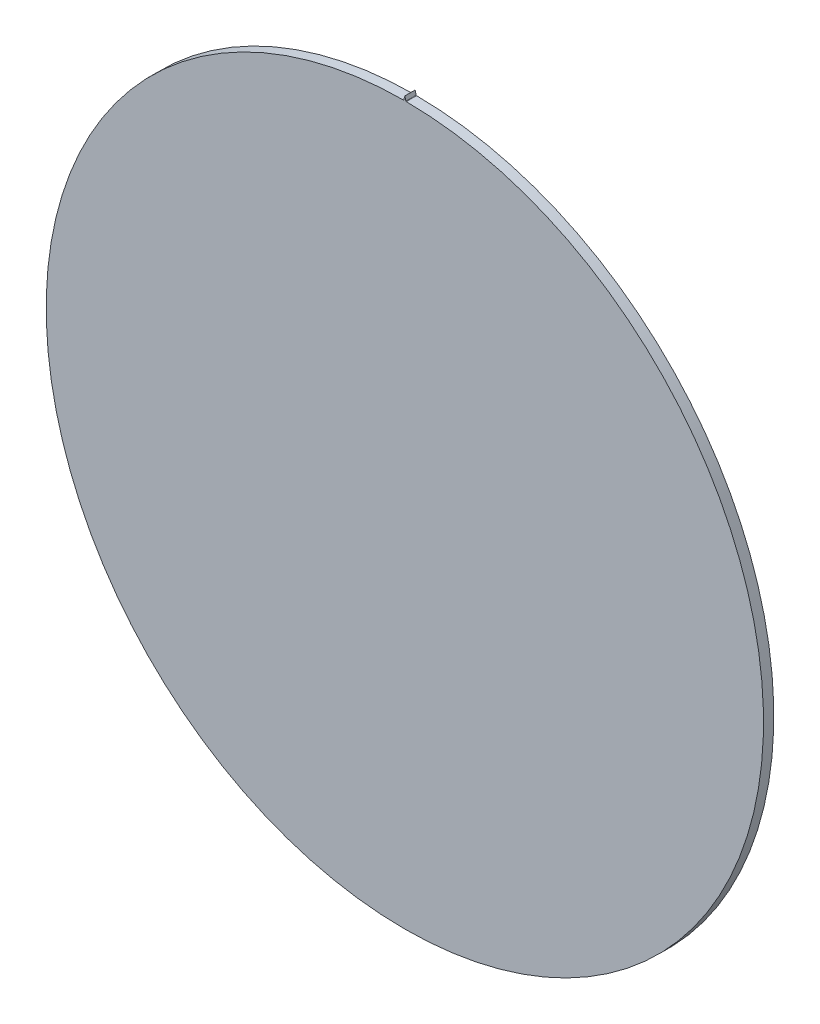
ISO-10303-21;
HEADER;
FILE_DESCRIPTION(('STEP AP214'),'2;1');
FILE_NAME('part.step','',(''),(''),'','','');
FILE_SCHEMA(('AUTOMOTIVE_DESIGN { 1 0 10303 214 1 1 1 1 }'));
ENDSEC;
DATA;
#1=APPLICATION_CONTEXT('core data for automotive mechanical design processes');
#2=APPLICATION_PROTOCOL_DEFINITION('international standard','automotive_design',2000,#1);
#3=PRODUCT_CONTEXT('',#1,'mechanical');
#4=PRODUCT('Part','Part','',(#3));
#5=PRODUCT_RELATED_PRODUCT_CATEGORY('part','',(#4));
#6=PRODUCT_DEFINITION_FORMATION('','',#4);
#7=PRODUCT_DEFINITION_CONTEXT('part definition',#1,'design');
#8=PRODUCT_DEFINITION('design','',#6,#7);
#9=PRODUCT_DEFINITION_SHAPE('','',#8);
#10=(LENGTH_UNIT() NAMED_UNIT(*) SI_UNIT(.MILLI.,.METRE.));
#11=(NAMED_UNIT(*) PLANE_ANGLE_UNIT() SI_UNIT($,.RADIAN.));
#12=(NAMED_UNIT(*) SI_UNIT($,.STERADIAN.) SOLID_ANGLE_UNIT());
#13=UNCERTAINTY_MEASURE_WITH_UNIT(LENGTH_MEASURE(1.E-05),#10,'distance_accuracy_value','');
#14=(GEOMETRIC_REPRESENTATION_CONTEXT(3) GLOBAL_UNCERTAINTY_ASSIGNED_CONTEXT((#13)) GLOBAL_UNIT_ASSIGNED_CONTEXT((#10,
#11,#12)) REPRESENTATION_CONTEXT('',''));
#15=CARTESIAN_POINT('',(0.,0.,0.));
#16=DIRECTION('',(0.,0.,1.));
#17=DIRECTION('',(1.,0.,0.));
#18=AXIS2_PLACEMENT_3D('',#15,#16,#17);
#19=CARTESIAN_POINT('',(0.,352.869005618267,10.));
#20=CARTESIAN_POINT('',(-0.0782322744899761,352.599791154151,10.));
#21=CARTESIAN_POINT('',(-0.192981436895399,352.198529985195,10.));
#22=CARTESIAN_POINT('',(-0.34132972041963,351.666617724108,10.));
#23=CARTESIAN_POINT('',(-0.448333974762531,351.276418011394,10.));
#24=CARTESIAN_POINT('',(-0.551988003788558,350.891907378865,10.));
#25=CARTESIAN_POINT('',(-0.652343171304687,350.513107425822,10.));
#26=CARTESIAN_POINT('',(-0.749450979050035,350.140039412834,10.));
#27=CARTESIAN_POINT('',(-0.873615316426641,349.654399425018,10.));
#28=CARTESIAN_POINT('',(-0.963620124942637,349.292664319115,10.));
#29=CARTESIAN_POINT('',(-1.02205554260628,349.053309932902,10.));
#30=B_SPLINE_CURVE_WITH_KNOTS('',3,(#19,#20,#21,#22,#23,#24,#25,#26,#27,#28,#29),.UNSPECIFIED.,
.F.,.F.,(4,1,1,1,1,1,1,1,4),(0.,0.212897122256029,0.316927472961058,0.419345683384068,
0.520151753525033,0.619345683384038,0.716927472961031,0.812897122256021,1.),.UNSPECIFIED.);
#31=DIRECTION('',(0.,0.,-1.));
#32=VECTOR('',#31,1.);
#33=SURFACE_OF_LINEAR_EXTRUSION('',#30,#32);
#34=CARTESIAN_POINT('',(0.,352.869005618267,0.));
#35=CARTESIAN_POINT('',(-0.0782322744899761,352.599791154151,0.));
#36=CARTESIAN_POINT('',(-0.192981436895399,352.198529985195,0.));
#37=CARTESIAN_POINT('',(-0.34132972041963,351.666617724108,0.));
#38=CARTESIAN_POINT('',(-0.448333974762531,351.276418011394,0.));
#39=CARTESIAN_POINT('',(-0.551988003788558,350.891907378865,0.));
#40=CARTESIAN_POINT('',(-0.652343171304687,350.513107425822,0.));
#41=CARTESIAN_POINT('',(-0.749450979050035,350.140039412834,0.));
#42=CARTESIAN_POINT('',(-0.873615316426641,349.654399425018,0.));
#43=CARTESIAN_POINT('',(-0.963620124942637,349.292664319115,0.));
#44=CARTESIAN_POINT('',(-1.02205554260628,349.053309932902,0.));
#45=B_SPLINE_CURVE_WITH_KNOTS('',3,(#34,#35,#36,#37,#38,#39,#40,#41,#42,#43,#44),.UNSPECIFIED.,
.F.,.F.,(4,1,1,1,1,1,1,1,4),(0.,0.212897122256029,0.316927472961058,0.419345683384068,
0.520151753525033,0.619345683384038,0.716927472961031,0.812897122256021,1.),.UNSPECIFIED.);
#46=CARTESIAN_POINT('',(0.,352.869005618267,0.));
#47=VERTEX_POINT('',#46);
#48=CARTESIAN_POINT('',(-1.02205554260628,349.053309932902,0.));
#49=VERTEX_POINT('',#48);
#50=EDGE_CURVE('E130',#47,#49,#45,.T.);
#51=ORIENTED_EDGE('',*,*,#50,.T.);
#52=DIRECTION('',(0.,0.,-1.));
#53=VECTOR('',#52,1.);
#54=CARTESIAN_POINT('',(-1.02205554260628,349.053309932902,10.));
#55=LINE('',#54,#53);
#56=CARTESIAN_POINT('',(-1.02205554260628,349.053309932902,10.));
#57=VERTEX_POINT('',#56);
#58=EDGE_CURVE('E11',#57,#49,#55,.T.);
#59=ORIENTED_EDGE('',*,*,#58,.F.);
#60=CARTESIAN_POINT('',(0.,352.869005618267,10.));
#61=VERTEX_POINT('',#60);
#62=EDGE_CURVE('E165',#61,#57,#30,.T.);
#63=ORIENTED_EDGE('',*,*,#62,.F.);
#64=DIRECTION('',(0.,0.,-1.));
#65=VECTOR('',#64,1.);
#66=CARTESIAN_POINT('',(0.,352.869005618267,10.));
#67=LINE('',#66,#65);
#68=EDGE_CURVE('E120',#61,#47,#67,.T.);
#69=ORIENTED_EDGE('',*,*,#68,.T.);
#70=EDGE_LOOP('',(#51,#59,#63,#69));
#71=FACE_BOUND('',#70,.T.);
#72=ADVANCED_FACE('F33',(#71),#33,.F.);
#73=CARTESIAN_POINT('',(-1.02205554260628,349.053309932902,10.));
#74=DIRECTION('',(0.968128255341182,-0.250454948463868,0.));
#75=DIRECTION('',(0.250454948463868,0.968128255341182,0.));
#76=AXIS2_PLACEMENT_3D('',#73,#74,#75);
#77=PLANE('',#76);
#78=DIRECTION('',(-0.250454948463868,-0.968128255341182,0.));
#79=VECTOR('',#78,1.);
#80=CARTESIAN_POINT('',(-1.02205554260628,349.053309932902,0.));
#81=LINE('',#80,#79);
#82=CARTESIAN_POINT('',(-1.02377241410056,349.046673402801,0.));
#83=VERTEX_POINT('',#82);
#84=EDGE_CURVE('E196',#49,#83,#81,.T.);
#85=ORIENTED_EDGE('',*,*,#84,.T.);
#86=DIRECTION('',(0.,0.,-1.));
#87=VECTOR('',#86,1.);
#88=CARTESIAN_POINT('',(-1.02377241410056,349.046673402801,10.));
#89=LINE('',#88,#87);
#90=CARTESIAN_POINT('',(-1.02377241410056,349.046673402801,10.));
#91=VERTEX_POINT('',#90);
#92=EDGE_CURVE('E42',#91,#83,#89,.T.);
#93=ORIENTED_EDGE('',*,*,#92,.F.);
#94=DIRECTION('',(-0.250454948463868,-0.968128255341182,0.));
#95=VECTOR('',#94,1.);
#96=CARTESIAN_POINT('',(-1.02205554260628,349.053309932902,10.));
#97=LINE('',#96,#95);
#98=EDGE_CURVE('E90',#57,#91,#97,.T.);
#99=ORIENTED_EDGE('',*,*,#98,.F.);
#100=ORIENTED_EDGE('',*,*,#58,.T.);
#101=EDGE_LOOP('',(#85,#93,#99,#100));
#102=FACE_BOUND('',#101,.T.);
#103=ADVANCED_FACE('F155',(#102),#77,.F.);
#104=CARTESIAN_POINT('',(-1.02377241410056,349.046673402801,10.));
#105=CARTESIAN_POINT('',(-1.02557885711728,349.039367157901,10.));
#106=CARTESIAN_POINT('',(-1.02936361178576,349.02616866359,10.));
#107=CARTESIAN_POINT('',(-1.03608846389118,349.00593009862,10.));
#108=CARTESIAN_POINT('',(-1.04458220274463,348.984022436377,10.));
#109=CARTESIAN_POINT('',(-1.05724321082471,348.95657927175,10.));
#110=CARTESIAN_POINT('',(-1.07733238328295,348.921228298662,10.));
#111=CARTESIAN_POINT('',(-1.11114696762105,348.875317400003,10.));
#112=CARTESIAN_POINT('',(-1.20383848568198,348.786123891811,10.));
#113=CARTESIAN_POINT('',(-1.31322603629112,348.746948966451,10.));
#114=CARTESIAN_POINT('',(-1.39788348877804,348.747198442872,10.));
#115=B_SPLINE_CURVE_WITH_KNOTS('',3,(#104,#105,#106,#107,#108,#109,#110,#111,#112,#113,#114),
.UNSPECIFIED.,.F.,.F.,(4,1,1,1,1,1,1,1,4),(0.,0.0438335060965132,0.0799398329506182,
0.124187196301171,0.180620643381694,0.255829386682252,0.360641088915001,0.511698593438129,1.),.UNSPECIFIED.);
#116=DIRECTION('',(0.,0.,-1.));
#117=VECTOR('',#116,1.);
#118=SURFACE_OF_LINEAR_EXTRUSION('',#115,#117);
#119=CARTESIAN_POINT('',(-1.02377241410056,349.046673402801,0.));
#120=CARTESIAN_POINT('',(-1.02557885711728,349.039367157901,0.));
#121=CARTESIAN_POINT('',(-1.02936361178576,349.02616866359,0.));
#122=CARTESIAN_POINT('',(-1.03608846389118,349.00593009862,0.));
#123=CARTESIAN_POINT('',(-1.04458220274463,348.984022436377,0.));
#124=CARTESIAN_POINT('',(-1.05724321082471,348.95657927175,0.));
#125=CARTESIAN_POINT('',(-1.07733238328295,348.921228298662,0.));
#126=CARTESIAN_POINT('',(-1.11114696762105,348.875317400003,0.));
#127=CARTESIAN_POINT('',(-1.20383848568198,348.786123891811,0.));
#128=CARTESIAN_POINT('',(-1.31322603629112,348.746948966451,0.));
#129=CARTESIAN_POINT('',(-1.39788348877804,348.747198442872,0.));
#130=B_SPLINE_CURVE_WITH_KNOTS('',3,(#119,#120,#121,#122,#123,#124,#125,#126,#127,#128,#129),
.UNSPECIFIED.,.F.,.F.,(4,1,1,1,1,1,1,1,4),(0.,0.0438335060965132,0.0799398329506182,
0.124187196301171,0.180620643381694,0.255829386682252,0.360641088915001,0.511698593438129,1.),.UNSPECIFIED.);
#131=CARTESIAN_POINT('',(-1.39788348877801,348.747198442872,0.));
#132=VERTEX_POINT('',#131);
#133=EDGE_CURVE('E192',#83,#132,#130,.T.);
#134=ORIENTED_EDGE('',*,*,#133,.T.);
#135=DIRECTION('',(0.,0.,-1.));
#136=VECTOR('',#135,1.);
#137=CARTESIAN_POINT('',(-1.39788348877801,348.747198442872,10.));
#138=LINE('',#137,#136);
#139=CARTESIAN_POINT('',(-1.39788348877801,348.747198442872,10.));
#140=VERTEX_POINT('',#139);
#141=EDGE_CURVE('E186',#140,#132,#138,.T.);
#142=ORIENTED_EDGE('',*,*,#141,.F.);
#143=EDGE_CURVE('E157',#91,#140,#115,.T.);
#144=ORIENTED_EDGE('',*,*,#143,.F.);
#145=ORIENTED_EDGE('',*,*,#92,.T.);
#146=EDGE_LOOP('',(#134,#142,#144,#145));
#147=FACE_BOUND('',#146,.T.);
#148=ADVANCED_FACE('F151',(#147),#118,.F.);
#149=CARTESIAN_POINT('',(0.,0.,10.));
#150=DIRECTION('',(0.,0.,-1.));
#151=DIRECTION('',(-1.,0.,0.));
#152=AXIS2_PLACEMENT_3D('',#149,#150,#151);
#153=CYLINDRICAL_SURFACE('',#152,348.75);
#154=CARTESIAN_POINT('',(0.,0.,0.));
#155=DIRECTION('',(0.,0.,1.));
#156=DIRECTION('',(1.,0.,0.));
#157=AXIS2_PLACEMENT_3D('',#154,#155,#156);
#158=CIRCLE('',#157,348.75);
#159=CARTESIAN_POINT('',(1.39788348877796,348.747198442872,0.));
#160=VERTEX_POINT('',#159);
#161=EDGE_CURVE('E197',#132,#160,#158,.T.);
#162=ORIENTED_EDGE('',*,*,#161,.T.);
#163=DIRECTION('',(0.,0.,-1.));
#164=VECTOR('',#163,1.);
#165=CARTESIAN_POINT('',(1.39788348877796,348.747198442872,10.));
#166=LINE('',#165,#164);
#167=CARTESIAN_POINT('',(1.39788348877796,348.747198442872,10.));
#168=VERTEX_POINT('',#167);
#169=EDGE_CURVE('E115',#168,#160,#166,.T.);
#170=ORIENTED_EDGE('',*,*,#169,.F.);
#171=CARTESIAN_POINT('',(0.,0.,10.));
#172=DIRECTION('',(0.,0.,1.));
#173=DIRECTION('',(1.,0.,0.));
#174=AXIS2_PLACEMENT_3D('',#171,#172,#173);
#175=CIRCLE('',#174,348.75);
#176=EDGE_CURVE('E106',#140,#168,#175,.T.);
#177=ORIENTED_EDGE('',*,*,#176,.F.);
#178=ORIENTED_EDGE('',*,*,#141,.T.);
#179=EDGE_LOOP('',(#162,#170,#177,#178));
#180=FACE_BOUND('',#179,.T.);
#181=ADVANCED_FACE('F148',(#180),#153,.T.);
#182=CARTESIAN_POINT('',(1.39788348877796,348.747198442872,10.));
#183=CARTESIAN_POINT('',(1.31322603629104,348.746948966451,10.));
#184=CARTESIAN_POINT('',(1.20383848568189,348.786123891811,10.));
#185=CARTESIAN_POINT('',(1.11114696762097,348.875317400003,10.));
#186=CARTESIAN_POINT('',(1.07733238328286,348.921228298662,10.));
#187=CARTESIAN_POINT('',(1.05724321082463,348.95657927175,10.));
#188=CARTESIAN_POINT('',(1.04458220274454,348.984022436377,10.));
#189=CARTESIAN_POINT('',(1.03608846389109,349.00593009862,10.));
#190=CARTESIAN_POINT('',(1.02936361178567,349.02616866359,10.));
#191=CARTESIAN_POINT('',(1.0255788571172,349.039367157901,10.));
#192=CARTESIAN_POINT('',(1.02377241410048,349.046673402801,10.));
#193=B_SPLINE_CURVE_WITH_KNOTS('',3,(#182,#183,#184,#185,#186,#187,#188,#189,#190,#191,#192),
.UNSPECIFIED.,.F.,.F.,(4,1,1,1,1,1,1,1,4),(0.,0.488301406561871,0.639358911084999,
0.744170613317748,0.819379356618306,0.875812803698829,0.920060167049382,0.956166493903487,1.),.UNSPECIFIED.);
#194=DIRECTION('',(0.,0.,-1.));
#195=VECTOR('',#194,1.);
#196=SURFACE_OF_LINEAR_EXTRUSION('',#193,#195);
#197=CARTESIAN_POINT('',(1.39788348877796,348.747198442872,0.));
#198=CARTESIAN_POINT('',(1.31322603629104,348.746948966451,0.));
#199=CARTESIAN_POINT('',(1.20383848568189,348.786123891811,0.));
#200=CARTESIAN_POINT('',(1.11114696762097,348.875317400003,0.));
#201=CARTESIAN_POINT('',(1.07733238328286,348.921228298662,0.));
#202=CARTESIAN_POINT('',(1.05724321082463,348.95657927175,0.));
#203=CARTESIAN_POINT('',(1.04458220274454,348.984022436377,0.));
#204=CARTESIAN_POINT('',(1.03608846389109,349.00593009862,0.));
#205=CARTESIAN_POINT('',(1.02936361178567,349.02616866359,0.));
#206=CARTESIAN_POINT('',(1.0255788571172,349.039367157901,0.));
#207=CARTESIAN_POINT('',(1.02377241410048,349.046673402801,0.));
#208=B_SPLINE_CURVE_WITH_KNOTS('',3,(#197,#198,#199,#200,#201,#202,#203,#204,#205,#206,#207),
.UNSPECIFIED.,.F.,.F.,(4,1,1,1,1,1,1,1,4),(0.,0.488301406561871,0.639358911084999,
0.744170613317748,0.819379356618306,0.875812803698829,0.920060167049382,0.956166493903487,1.),.UNSPECIFIED.);
#209=CARTESIAN_POINT('',(1.02377241410048,349.046673402801,0.));
#210=VERTEX_POINT('',#209);
#211=EDGE_CURVE('E114',#160,#210,#208,.T.);
#212=ORIENTED_EDGE('',*,*,#211,.T.);
#213=DIRECTION('',(0.,0.,-1.));
#214=VECTOR('',#213,1.);
#215=CARTESIAN_POINT('',(1.02377241410048,349.046673402801,10.));
#216=LINE('',#215,#214);
#217=CARTESIAN_POINT('',(1.02377241410048,349.046673402801,10.));
#218=VERTEX_POINT('',#217);
#219=EDGE_CURVE('E111',#218,#210,#216,.T.);
#220=ORIENTED_EDGE('',*,*,#219,.F.);
#221=EDGE_CURVE('E100',#168,#218,#193,.T.);
#222=ORIENTED_EDGE('',*,*,#221,.F.);
#223=ORIENTED_EDGE('',*,*,#169,.T.);
#224=EDGE_LOOP('',(#212,#220,#222,#223));
#225=FACE_BOUND('',#224,.T.);
#226=ADVANCED_FACE('F112',(#225),#196,.F.);
#227=CARTESIAN_POINT('',(1.0220555426062,349.053309932902,10.));
#228=DIRECTION('',(-0.968128255341182,-0.250454948463868,0.));
#229=DIRECTION('',(0.250454948463868,-0.968128255341182,0.));
#230=AXIS2_PLACEMENT_3D('',#227,#228,#229);
#231=PLANE('',#230);
#232=DIRECTION('',(-0.250454948463868,0.968128255341182,0.));
#233=VECTOR('',#232,1.);
#234=CARTESIAN_POINT('',(1.0220555426062,349.053309932902,0.));
#235=LINE('',#234,#233);
#236=CARTESIAN_POINT('',(1.0220555426062,349.053309932902,0.));
#237=VERTEX_POINT('',#236);
#238=EDGE_CURVE('E76',#210,#237,#235,.T.);
#239=ORIENTED_EDGE('',*,*,#238,.T.);
#240=DIRECTION('',(0.,0.,-1.));
#241=VECTOR('',#240,1.);
#242=CARTESIAN_POINT('',(1.0220555426062,349.053309932902,10.));
#243=LINE('',#242,#241);
#244=CARTESIAN_POINT('',(1.0220555426062,349.053309932902,10.));
#245=VERTEX_POINT('',#244);
#246=EDGE_CURVE('E116',#245,#237,#243,.T.);
#247=ORIENTED_EDGE('',*,*,#246,.F.);
#248=DIRECTION('',(-0.250454948463868,0.968128255341182,0.));
#249=VECTOR('',#248,1.);
#250=CARTESIAN_POINT('',(1.0220555426062,349.053309932902,10.));
#251=LINE('',#250,#249);
#252=EDGE_CURVE('E104',#218,#245,#251,.T.);
#253=ORIENTED_EDGE('',*,*,#252,.F.);
#254=ORIENTED_EDGE('',*,*,#219,.T.);
#255=EDGE_LOOP('',(#239,#247,#253,#254));
#256=FACE_BOUND('',#255,.T.);
#257=ADVANCED_FACE('F118',(#256),#231,.F.);
#258=CARTESIAN_POINT('',(1.0220555426062,349.053309932902,10.));
#259=CARTESIAN_POINT('',(0.963620124942551,349.292664319115,10.));
#260=CARTESIAN_POINT('',(0.873615316426555,349.654399425018,10.));
#261=CARTESIAN_POINT('',(0.749450979049949,350.140039412835,10.));
#262=CARTESIAN_POINT('',(0.652343171304601,350.513107425822,10.));
#263=CARTESIAN_POINT('',(0.551988003788472,350.891907378865,10.));
#264=CARTESIAN_POINT('',(0.448333974762445,351.276418011394,10.));
#265=CARTESIAN_POINT('',(0.341329720419544,351.666617724108,10.));
#266=CARTESIAN_POINT('',(0.192981436895313,352.198529985195,10.));
#267=CARTESIAN_POINT('',(0.0782322744898897,352.599791154151,10.));
#268=CARTESIAN_POINT('',(0.,352.869005618267,10.));
#269=B_SPLINE_CURVE_WITH_KNOTS('',3,(#258,#259,#260,#261,#262,#263,#264,#265,#266,#267,#268),
.UNSPECIFIED.,.F.,.F.,(4,1,1,1,1,1,1,1,4),(0.,0.187102877743979,0.283072527038969,
0.380654316615962,0.479848246474967,0.580654316615932,0.683072527038942,0.787102877743971,1.),.UNSPECIFIED.);
#270=DIRECTION('',(0.,0.,-1.));
#271=VECTOR('',#270,1.);
#272=SURFACE_OF_LINEAR_EXTRUSION('',#269,#271);
#273=CARTESIAN_POINT('',(1.0220555426062,349.053309932902,0.));
#274=CARTESIAN_POINT('',(0.963620124942551,349.292664319115,0.));
#275=CARTESIAN_POINT('',(0.873615316426555,349.654399425018,0.));
#276=CARTESIAN_POINT('',(0.749450979049949,350.140039412835,0.));
#277=CARTESIAN_POINT('',(0.652343171304601,350.513107425822,0.));
#278=CARTESIAN_POINT('',(0.551988003788472,350.891907378865,0.));
#279=CARTESIAN_POINT('',(0.448333974762445,351.276418011394,0.));
#280=CARTESIAN_POINT('',(0.341329720419544,351.666617724108,0.));
#281=CARTESIAN_POINT('',(0.192981436895313,352.198529985195,0.));
#282=CARTESIAN_POINT('',(0.0782322744898897,352.599791154151,0.));
#283=CARTESIAN_POINT('',(0.,352.869005618267,0.));
#284=B_SPLINE_CURVE_WITH_KNOTS('',3,(#273,#274,#275,#276,#277,#278,#279,#280,#281,#282,#283),
.UNSPECIFIED.,.F.,.F.,(4,1,1,1,1,1,1,1,4),(0.,0.187102877743979,0.283072527038969,
0.380654316615962,0.479848246474967,0.580654316615932,0.683072527038942,0.787102877743971,1.),.UNSPECIFIED.);
#285=EDGE_CURVE('E82',#237,#47,#284,.T.);
#286=ORIENTED_EDGE('',*,*,#285,.T.);
#287=ORIENTED_EDGE('',*,*,#68,.F.);
#288=EDGE_CURVE('E50',#245,#61,#269,.T.);
#289=ORIENTED_EDGE('',*,*,#288,.F.);
#290=ORIENTED_EDGE('',*,*,#246,.T.);
#291=EDGE_LOOP('',(#286,#287,#289,#290));
#292=FACE_BOUND('',#291,.T.);
#293=ADVANCED_FACE('F138',(#292),#272,.F.);
#294=CARTESIAN_POINT('',(-0.531673766590665,350.966684704309,10.));
#295=DIRECTION('',(0.,0.,-1.));
#296=DIRECTION('',(-1.,0.,0.));
#297=AXIS2_PLACEMENT_3D('',#294,#295,#296);
#298=PLANE('',#297);
#299=ORIENTED_EDGE('',*,*,#62,.T.);
#300=ORIENTED_EDGE('',*,*,#98,.T.);
#301=ORIENTED_EDGE('',*,*,#143,.T.);
#302=ORIENTED_EDGE('',*,*,#176,.T.);
#303=ORIENTED_EDGE('',*,*,#221,.T.);
#304=ORIENTED_EDGE('',*,*,#252,.T.);
#305=ORIENTED_EDGE('',*,*,#288,.T.);
#306=EDGE_LOOP('',(#299,#300,#301,#302,#303,#304,#305));
#307=FACE_BOUND('',#306,.T.);
#308=ADVANCED_FACE('F102',(#307),#298,.F.);
#309=CARTESIAN_POINT('',(-0.531673766590665,350.966684704309,0.));
#310=DIRECTION('',(0.,0.,-1.));
#311=DIRECTION('',(-1.,0.,0.));
#312=AXIS2_PLACEMENT_3D('',#309,#310,#311);
#313=PLANE('',#312);
#314=ORIENTED_EDGE('',*,*,#50,.F.);
#315=ORIENTED_EDGE('',*,*,#285,.F.);
#316=ORIENTED_EDGE('',*,*,#238,.F.);
#317=ORIENTED_EDGE('',*,*,#211,.F.);
#318=ORIENTED_EDGE('',*,*,#161,.F.);
#319=ORIENTED_EDGE('',*,*,#133,.F.);
#320=ORIENTED_EDGE('',*,*,#84,.F.);
#321=EDGE_LOOP('',(#314,#315,#316,#317,#318,#319,#320));
#322=FACE_BOUND('',#321,.T.);
#323=ADVANCED_FACE('F142',(#322),#313,.T.);
#324=CLOSED_SHELL('',(#72,#103,#148,#181,#226,#257,#293,#308,#323));
#325=MANIFOLD_SOLID_BREP('B2',#324);
#326=ADVANCED_BREP_SHAPE_REPRESENTATION('',(#18,#325),#14);
#327=SHAPE_DEFINITION_REPRESENTATION(#9,#326);
ENDSEC;
END-ISO-10303-21;
